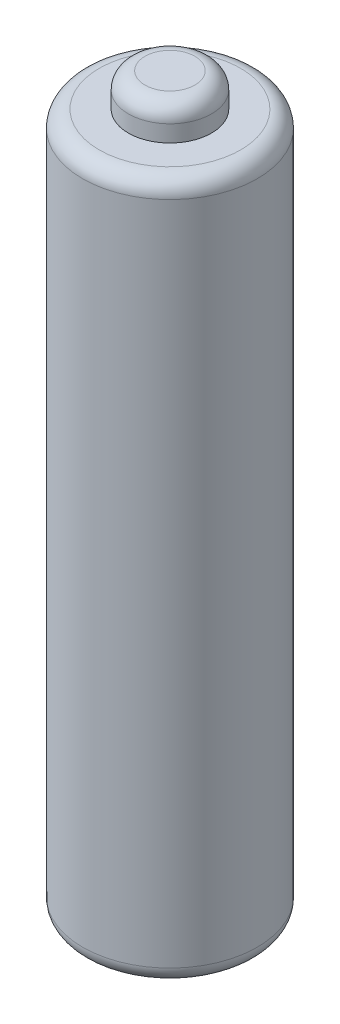
ISO-10303-21;
HEADER;
FILE_DESCRIPTION(('STEP AP214'),'2;1');
FILE_NAME('part.step','',(''),(''),'','','');
FILE_SCHEMA(('AUTOMOTIVE_DESIGN { 1 0 10303 214 1 1 1 1 }'));
ENDSEC;
DATA;
#1=APPLICATION_CONTEXT('core data for automotive mechanical design processes');
#2=APPLICATION_PROTOCOL_DEFINITION('international standard','automotive_design',2000,#1);
#3=PRODUCT_CONTEXT('',#1,'mechanical');
#4=PRODUCT('Part','Part','',(#3));
#5=PRODUCT_RELATED_PRODUCT_CATEGORY('part','',(#4));
#6=PRODUCT_DEFINITION_FORMATION('','',#4);
#7=PRODUCT_DEFINITION_CONTEXT('part definition',#1,'design');
#8=PRODUCT_DEFINITION('design','',#6,#7);
#9=PRODUCT_DEFINITION_SHAPE('','',#8);
#10=(LENGTH_UNIT() NAMED_UNIT(*) SI_UNIT(.MILLI.,.METRE.));
#11=(NAMED_UNIT(*) PLANE_ANGLE_UNIT() SI_UNIT($,.RADIAN.));
#12=(NAMED_UNIT(*) SI_UNIT($,.STERADIAN.) SOLID_ANGLE_UNIT());
#13=UNCERTAINTY_MEASURE_WITH_UNIT(LENGTH_MEASURE(1.E-05),#10,'distance_accuracy_value','');
#14=(GEOMETRIC_REPRESENTATION_CONTEXT(3) GLOBAL_UNCERTAINTY_ASSIGNED_CONTEXT((#13)) GLOBAL_UNIT_ASSIGNED_CONTEXT((#10,
#11,#12)) REPRESENTATION_CONTEXT('',''));
#15=CARTESIAN_POINT('',(0.,0.,0.));
#16=DIRECTION('',(0.,0.,1.));
#17=DIRECTION('',(1.,0.,0.));
#18=AXIS2_PLACEMENT_3D('',#15,#16,#17);
#19=CARTESIAN_POINT('',(0.,42.,0.));
#20=DIRECTION('',(0.,-1.,0.));
#21=DIRECTION('',(0.,0.,-1.));
#22=AXIS2_PLACEMENT_3D('',#19,#20,#21);
#23=CYLINDRICAL_SURFACE('',#22,5.25);
#24=CARTESIAN_POINT('',(0.,1.,0.));
#25=DIRECTION('',(0.,1.,0.));
#26=DIRECTION('',(0.,0.,1.));
#27=AXIS2_PLACEMENT_3D('',#24,#25,#26);
#28=CIRCLE('',#27,5.25);
#29=CARTESIAN_POINT('',(0.,1.,5.25));
#30=VERTEX_POINT('',#29);
#31=EDGE_CURVE('E55',#30,#30,#28,.T.);
#32=ORIENTED_EDGE('',*,*,#31,.T.);
#33=EDGE_LOOP('',(#32));
#34=FACE_BOUND('',#33,.T.);
#35=CARTESIAN_POINT('',(0.,41.,0.));
#36=DIRECTION('',(0.,1.,0.));
#37=DIRECTION('',(0.,0.,1.));
#38=AXIS2_PLACEMENT_3D('',#35,#36,#37);
#39=CIRCLE('',#38,5.25);
#40=CARTESIAN_POINT('',(0.,41.,5.25));
#41=VERTEX_POINT('',#40);
#42=EDGE_CURVE('E60',#41,#41,#39,.F.);
#43=ORIENTED_EDGE('',*,*,#42,.T.);
#44=EDGE_LOOP('',(#43));
#45=FACE_BOUND('',#44,.T.);
#46=ADVANCED_FACE('F42',(#34,#45),#23,.T.);
#47=CARTESIAN_POINT('',(0.,42.,0.));
#48=DIRECTION('',(0.,1.,0.));
#49=DIRECTION('',(0.,0.,1.));
#50=AXIS2_PLACEMENT_3D('',#47,#48,#49);
#51=PLANE('',#50);
#52=CARTESIAN_POINT('',(0.,42.,0.));
#53=DIRECTION('',(0.,1.,0.));
#54=DIRECTION('',(0.,0.,1.));
#55=AXIS2_PLACEMENT_3D('',#52,#53,#54);
#56=CIRCLE('',#55,4.25);
#57=CARTESIAN_POINT('',(0.,42.,4.25));
#58=VERTEX_POINT('',#57);
#59=EDGE_CURVE('E10',#58,#58,#56,.T.);
#60=ORIENTED_EDGE('',*,*,#59,.T.);
#61=EDGE_LOOP('',(#60));
#62=FACE_BOUND('',#61,.T.);
#63=CARTESIAN_POINT('',(0.,42.,0.));
#64=DIRECTION('',(0.,1.,0.));
#65=DIRECTION('',(0.,0.,1.));
#66=AXIS2_PLACEMENT_3D('',#63,#64,#65);
#67=CIRCLE('',#66,2.5);
#68=CARTESIAN_POINT('',(0.,42.,2.5));
#69=VERTEX_POINT('',#68);
#70=EDGE_CURVE('E74',#69,#69,#67,.T.);
#71=ORIENTED_EDGE('',*,*,#70,.F.);
#72=EDGE_LOOP('',(#71));
#73=FACE_BOUND('',#72,.T.);
#74=ADVANCED_FACE('F81',(#62,#73),#51,.T.);
#75=CARTESIAN_POINT('',(0.,0.,0.));
#76=DIRECTION('',(0.,1.,0.));
#77=DIRECTION('',(0.,0.,1.));
#78=AXIS2_PLACEMENT_3D('',#75,#76,#77);
#79=PLANE('',#78);
#80=CARTESIAN_POINT('',(0.,0.,0.));
#81=DIRECTION('',(0.,1.,0.));
#82=DIRECTION('',(0.,0.,1.));
#83=AXIS2_PLACEMENT_3D('',#80,#81,#82);
#84=CIRCLE('',#83,4.25);
#85=CARTESIAN_POINT('',(0.,0.,4.25));
#86=VERTEX_POINT('',#85);
#87=EDGE_CURVE('E50',#86,#86,#84,.F.);
#88=ORIENTED_EDGE('',*,*,#87,.T.);
#89=EDGE_LOOP('',(#88));
#90=FACE_BOUND('',#89,.T.);
#91=ADVANCED_FACE('F83',(#90),#79,.F.);
#92=CARTESIAN_POINT('',(0.,44.,0.));
#93=DIRECTION('',(0.,-1.,0.));
#94=DIRECTION('',(0.,0.,-1.));
#95=AXIS2_PLACEMENT_3D('',#92,#93,#94);
#96=CYLINDRICAL_SURFACE('',#95,2.5);
#97=CARTESIAN_POINT('',(0.,43.,0.));
#98=DIRECTION('',(0.,1.,0.));
#99=DIRECTION('',(0.,0.,1.));
#100=AXIS2_PLACEMENT_3D('',#97,#98,#99);
#101=CIRCLE('',#100,2.5);
#102=CARTESIAN_POINT('',(0.,43.,2.5));
#103=VERTEX_POINT('',#102);
#104=EDGE_CURVE('E66',#103,#103,#101,.F.);
#105=ORIENTED_EDGE('',*,*,#104,.T.);
#106=EDGE_LOOP('',(#105));
#107=FACE_BOUND('',#106,.T.);
#108=ORIENTED_EDGE('',*,*,#70,.T.);
#109=EDGE_LOOP('',(#108));
#110=FACE_BOUND('',#109,.T.);
#111=ADVANCED_FACE('F79',(#107,#110),#96,.T.);
#112=CARTESIAN_POINT('',(0.,44.,0.));
#113=DIRECTION('',(0.,1.,0.));
#114=DIRECTION('',(0.,0.,1.));
#115=AXIS2_PLACEMENT_3D('',#112,#113,#114);
#116=PLANE('',#115);
#117=CARTESIAN_POINT('',(0.,44.,0.));
#118=DIRECTION('',(0.,1.,0.));
#119=DIRECTION('',(0.,0.,1.));
#120=AXIS2_PLACEMENT_3D('',#117,#118,#119);
#121=CIRCLE('',#120,1.5);
#122=CARTESIAN_POINT('',(0.,44.,1.5));
#123=VERTEX_POINT('',#122);
#124=EDGE_CURVE('E70',#123,#123,#121,.T.);
#125=ORIENTED_EDGE('',*,*,#124,.T.);
#126=EDGE_LOOP('',(#125));
#127=FACE_BOUND('',#126,.T.);
#128=ADVANCED_FACE('F98',(#127),#116,.T.);
#129=CARTESIAN_POINT('',(0.,43.,0.));
#130=DIRECTION('',(0.,1.,0.));
#131=DIRECTION('',(0.,0.,1.));
#132=AXIS2_PLACEMENT_3D('',#129,#130,#131);
#133=TOROIDAL_SURFACE('',#132,1.5,1.);
#134=ORIENTED_EDGE('',*,*,#104,.F.);
#135=EDGE_LOOP('',(#134));
#136=FACE_BOUND('',#135,.T.);
#137=ORIENTED_EDGE('',*,*,#124,.F.);
#138=EDGE_LOOP('',(#137));
#139=FACE_BOUND('',#138,.T.);
#140=ADVANCED_FACE('F95',(#136,#139),#133,.T.);
#141=CARTESIAN_POINT('',(0.,1.,0.));
#142=DIRECTION('',(0.,1.,0.));
#143=DIRECTION('',(0.,0.,1.));
#144=AXIS2_PLACEMENT_3D('',#141,#142,#143);
#145=TOROIDAL_SURFACE('',#144,4.25,1.);
#146=ORIENTED_EDGE('',*,*,#87,.F.);
#147=EDGE_LOOP('',(#146));
#148=FACE_BOUND('',#147,.T.);
#149=ORIENTED_EDGE('',*,*,#31,.F.);
#150=EDGE_LOOP('',(#149));
#151=FACE_BOUND('',#150,.T.);
#152=ADVANCED_FACE('F97',(#148,#151),#145,.T.);
#153=CARTESIAN_POINT('',(0.,41.,0.));
#154=DIRECTION('',(0.,1.,0.));
#155=DIRECTION('',(0.,0.,1.));
#156=AXIS2_PLACEMENT_3D('',#153,#154,#155);
#157=TOROIDAL_SURFACE('',#156,4.25,1.);
#158=ORIENTED_EDGE('',*,*,#42,.F.);
#159=EDGE_LOOP('',(#158));
#160=FACE_BOUND('',#159,.T.);
#161=ORIENTED_EDGE('',*,*,#59,.F.);
#162=EDGE_LOOP('',(#161));
#163=FACE_BOUND('',#162,.T.);
#164=ADVANCED_FACE('F44',(#160,#163),#157,.T.);
#165=CLOSED_SHELL('',(#46,#74,#91,#111,#128,#140,#152,#164));
#166=MANIFOLD_SOLID_BREP('B2',#165);
#167=ADVANCED_BREP_SHAPE_REPRESENTATION('',(#18,#166),#14);
#168=SHAPE_DEFINITION_REPRESENTATION(#9,#167);
ENDSEC;
END-ISO-10303-21;
